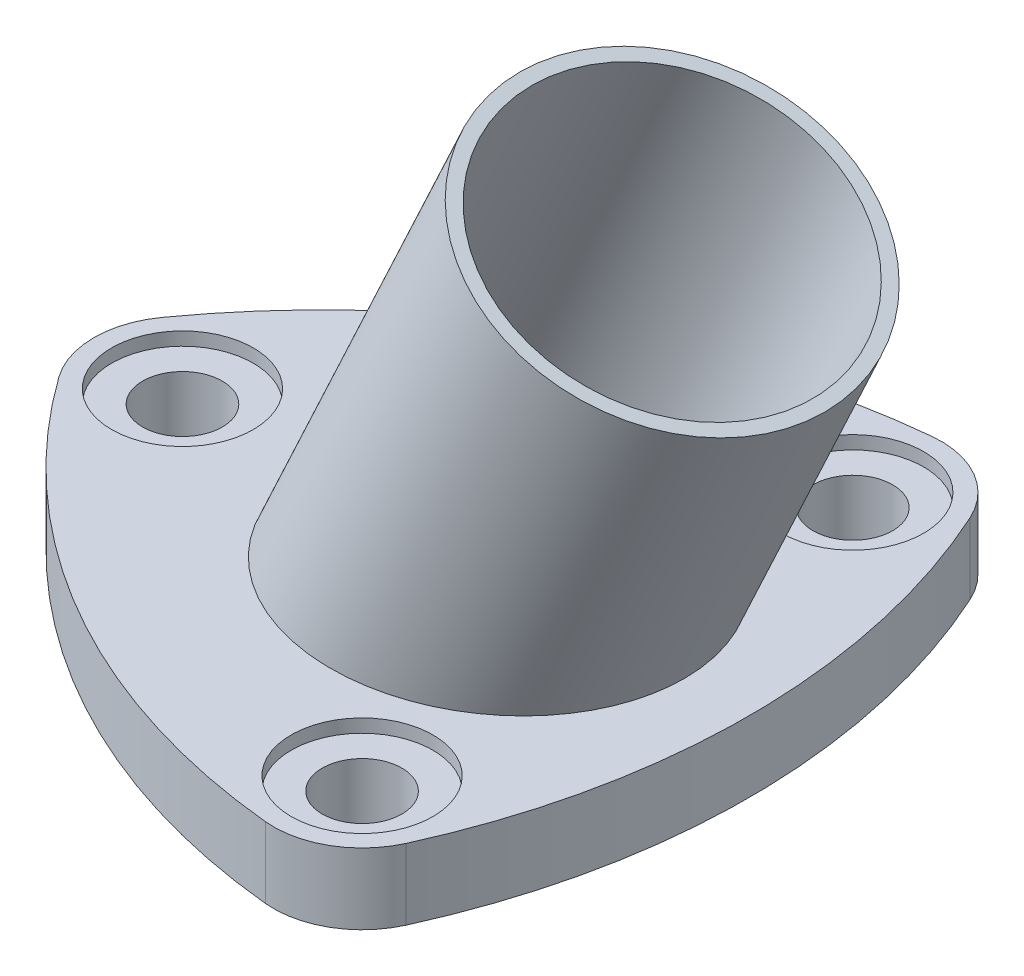
ISO-10303-21;
HEADER;
FILE_DESCRIPTION(('STEP AP214'),'2;1');
FILE_NAME('part.step','',(''),(''),'','','');
FILE_SCHEMA(('AUTOMOTIVE_DESIGN { 1 0 10303 214 1 1 1 1 }'));
ENDSEC;
DATA;
#1=APPLICATION_CONTEXT('core data for automotive mechanical design processes');
#2=APPLICATION_PROTOCOL_DEFINITION('international standard','automotive_design',2000,#1);
#3=PRODUCT_CONTEXT('',#1,'mechanical');
#4=PRODUCT('Part','Part','',(#3));
#5=PRODUCT_RELATED_PRODUCT_CATEGORY('part','',(#4));
#6=PRODUCT_DEFINITION_FORMATION('','',#4);
#7=PRODUCT_DEFINITION_CONTEXT('part definition',#1,'design');
#8=PRODUCT_DEFINITION('design','',#6,#7);
#9=PRODUCT_DEFINITION_SHAPE('','',#8);
#10=(LENGTH_UNIT() NAMED_UNIT(*) SI_UNIT(.MILLI.,.METRE.));
#11=(NAMED_UNIT(*) PLANE_ANGLE_UNIT() SI_UNIT($,.RADIAN.));
#12=(NAMED_UNIT(*) SI_UNIT($,.STERADIAN.) SOLID_ANGLE_UNIT());
#13=UNCERTAINTY_MEASURE_WITH_UNIT(LENGTH_MEASURE(1.E-05),#10,'distance_accuracy_value','');
#14=(GEOMETRIC_REPRESENTATION_CONTEXT(3) GLOBAL_UNCERTAINTY_ASSIGNED_CONTEXT((#13)) GLOBAL_UNIT_ASSIGNED_CONTEXT((#10,
#11,#12)) REPRESENTATION_CONTEXT('',''));
#15=CARTESIAN_POINT('',(0.,0.,0.));
#16=DIRECTION('',(0.,0.,1.));
#17=DIRECTION('',(1.,0.,0.));
#18=AXIS2_PLACEMENT_3D('',#15,#16,#17);
#19=CARTESIAN_POINT('',(-32.,8.,0.));
#20=DIRECTION('',(0.,-1.,0.));
#21=DIRECTION('',(0.,0.,-1.));
#22=AXIS2_PLACEMENT_3D('',#19,#20,#21);
#23=CYLINDRICAL_SURFACE('',#22,4.50000000000001);
#24=CARTESIAN_POINT('',(-32.,0.,0.));
#25=DIRECTION('',(0.,1.,0.));
#26=DIRECTION('',(0.,0.,1.));
#27=AXIS2_PLACEMENT_3D('',#24,#25,#26);
#28=CIRCLE('',#27,4.50000000000001);
#29=CARTESIAN_POINT('',(-32.,0.,4.50000000000001));
#30=VERTEX_POINT('',#29);
#31=EDGE_CURVE('E123',#30,#30,#28,.T.);
#32=ORIENTED_EDGE('',*,*,#31,.F.);
#33=EDGE_LOOP('',(#32));
#34=FACE_BOUND('',#33,.T.);
#35=CARTESIAN_POINT('',(-32.,6.5,0.));
#36=DIRECTION('',(0.,1.,0.));
#37=DIRECTION('',(0.,0.,1.));
#38=AXIS2_PLACEMENT_3D('',#35,#36,#37);
#39=CIRCLE('',#38,4.50000000000001);
#40=CARTESIAN_POINT('',(-32.,6.5,4.50000000000001));
#41=VERTEX_POINT('',#40);
#42=EDGE_CURVE('E144',#41,#41,#39,.T.);
#43=ORIENTED_EDGE('',*,*,#42,.T.);
#44=EDGE_LOOP('',(#43));
#45=FACE_BOUND('',#44,.T.);
#46=ADVANCED_FACE('F33',(#34,#45),#23,.F.);
#47=CARTESIAN_POINT('',(16.,8.,-27.712812921102));
#48=DIRECTION('',(0.,-1.,0.));
#49=DIRECTION('',(0.,0.,-1.));
#50=AXIS2_PLACEMENT_3D('',#47,#48,#49);
#51=CYLINDRICAL_SURFACE('',#50,4.50000000000004);
#52=CARTESIAN_POINT('',(16.,0.,-27.712812921102));
#53=DIRECTION('',(0.,1.,0.));
#54=DIRECTION('',(0.,0.,1.));
#55=AXIS2_PLACEMENT_3D('',#52,#53,#54);
#56=CIRCLE('',#55,4.50000000000004);
#57=CARTESIAN_POINT('',(16.,0.,-23.212812921102));
#58=VERTEX_POINT('',#57);
#59=EDGE_CURVE('E150',#58,#58,#56,.T.);
#60=ORIENTED_EDGE('',*,*,#59,.F.);
#61=EDGE_LOOP('',(#60));
#62=FACE_BOUND('',#61,.T.);
#63=CARTESIAN_POINT('',(16.,6.5,-27.712812921102));
#64=DIRECTION('',(0.,1.,0.));
#65=DIRECTION('',(0.,0.,1.));
#66=AXIS2_PLACEMENT_3D('',#63,#64,#65);
#67=CIRCLE('',#66,4.50000000000004);
#68=CARTESIAN_POINT('',(16.,6.5,-23.212812921102));
#69=VERTEX_POINT('',#68);
#70=EDGE_CURVE('E141',#69,#69,#67,.T.);
#71=ORIENTED_EDGE('',*,*,#70,.T.);
#72=EDGE_LOOP('',(#71));
#73=FACE_BOUND('',#72,.T.);
#74=ADVANCED_FACE('F188',(#62,#73),#51,.F.);
#75=CARTESIAN_POINT('',(16.,8.,27.712812921102));
#76=DIRECTION('',(0.,-1.,0.));
#77=DIRECTION('',(0.,0.,-1.));
#78=AXIS2_PLACEMENT_3D('',#75,#76,#77);
#79=CYLINDRICAL_SURFACE('',#78,4.5000000000001);
#80=CARTESIAN_POINT('',(16.,0.,27.712812921102));
#81=DIRECTION('',(0.,1.,0.));
#82=DIRECTION('',(0.,0.,1.));
#83=AXIS2_PLACEMENT_3D('',#80,#81,#82);
#84=CIRCLE('',#83,4.5000000000001);
#85=CARTESIAN_POINT('',(16.,0.,32.2128129211021));
#86=VERTEX_POINT('',#85);
#87=EDGE_CURVE('E146',#86,#86,#84,.T.);
#88=ORIENTED_EDGE('',*,*,#87,.F.);
#89=EDGE_LOOP('',(#88));
#90=FACE_BOUND('',#89,.T.);
#91=CARTESIAN_POINT('',(16.,6.5,27.712812921102));
#92=DIRECTION('',(0.,1.,0.));
#93=DIRECTION('',(0.,0.,1.));
#94=AXIS2_PLACEMENT_3D('',#91,#92,#93);
#95=CIRCLE('',#94,4.5000000000001);
#96=CARTESIAN_POINT('',(16.,6.5,32.2128129211021));
#97=VERTEX_POINT('',#96);
#98=EDGE_CURVE('E138',#97,#97,#95,.T.);
#99=ORIENTED_EDGE('',*,*,#98,.T.);
#100=EDGE_LOOP('',(#99));
#101=FACE_BOUND('',#100,.T.);
#102=ADVANCED_FACE('F194',(#90,#101),#79,.F.);
#103=CARTESIAN_POINT('',(19.25,8.,-5.62916512459887));
#104=DIRECTION('',(0.,1.,0.));
#105=DIRECTION('',(0.,0.,1.));
#106=AXIS2_PLACEMENT_3D('',#103,#104,#105);
#107=PLANE('',#106);
#108=CARTESIAN_POINT('',(3.73046126523997,8.,0.));
#109=DIRECTION('',(0.,1.,0.));
#110=DIRECTION('',(1.,0.,0.));
#111=AXIS2_PLACEMENT_3D('',#108,#109,#110);
#112=ELLIPSE('',#111,20.9641804602873,19.);
#113=CARTESIAN_POINT('',(24.6946417255273,8.,0.));
#114=VERTEX_POINT('',#113);
#115=EDGE_CURVE('E11',#114,#114,#112,.T.);
#116=ORIENTED_EDGE('',*,*,#115,.F.);
#117=EDGE_LOOP('',(#116));
#118=FACE_BOUND('',#117,.T.);
#119=CARTESIAN_POINT('',(-32.,8.,0.));
#120=DIRECTION('',(0.,1.,0.));
#121=DIRECTION('',(0.,0.,1.));
#122=AXIS2_PLACEMENT_3D('',#119,#120,#121);
#123=CIRCLE('',#122,8.);
#124=CARTESIAN_POINT('',(-32.,8.,8.));
#125=VERTEX_POINT('',#124);
#126=EDGE_CURVE('E221',#125,#125,#123,.T.);
#127=ORIENTED_EDGE('',*,*,#126,.F.);
#128=EDGE_LOOP('',(#127));
#129=FACE_BOUND('',#128,.T.);
#130=CARTESIAN_POINT('',(16.0000000000001,8.,-27.712812921102));
#131=DIRECTION('',(0.,1.,0.));
#132=DIRECTION('',(0.,0.,1.));
#133=AXIS2_PLACEMENT_3D('',#130,#131,#132);
#134=CIRCLE('',#133,8.00000000000001);
#135=CARTESIAN_POINT('',(16.0000000000001,8.,-19.712812921102));
#136=VERTEX_POINT('',#135);
#137=EDGE_CURVE('E227',#136,#136,#134,.T.);
#138=ORIENTED_EDGE('',*,*,#137,.F.);
#139=EDGE_LOOP('',(#138));
#140=FACE_BOUND('',#139,.T.);
#141=CARTESIAN_POINT('',(15.9999999999998,8.,27.7128129211022));
#142=DIRECTION('',(0.,1.,0.));
#143=DIRECTION('',(0.,0.,1.));
#144=AXIS2_PLACEMENT_3D('',#141,#142,#143);
#145=CIRCLE('',#144,8.);
#146=CARTESIAN_POINT('',(15.9999999999998,8.,35.7128129211022));
#147=VERTEX_POINT('',#146);
#148=EDGE_CURVE('E157',#147,#147,#145,.T.);
#149=ORIENTED_EDGE('',*,*,#148,.F.);
#150=EDGE_LOOP('',(#149));
#151=FACE_BOUND('',#150,.T.);
#152=CARTESIAN_POINT('',(22.5,8.,-38.9711431702998));
#153=DIRECTION('',(0.,1.,0.));
#154=DIRECTION('',(0.,0.,1.));
#155=AXIS2_PLACEMENT_3D('',#152,#153,#154);
#156=CIRCLE('',#155,77.);
#157=CARTESIAN_POINT('',(-40.1343283582089,8.,5.81658853288056));
#158=VERTEX_POINT('',#157);
#159=CARTESIAN_POINT('',(15.0298507462687,8.,37.6656421884754));
#160=VERTEX_POINT('',#159);
#161=EDGE_CURVE('E130',#158,#160,#156,.T.);
#162=ORIENTED_EDGE('',*,*,#161,.T.);
#163=CARTESIAN_POINT('',(16.,8.,27.712812921102));
#164=DIRECTION('',(0.,1.,0.));
#165=DIRECTION('',(0.,0.,1.));
#166=AXIS2_PLACEMENT_3D('',#163,#164,#165);
#167=CIRCLE('',#166,10.);
#168=CARTESIAN_POINT('',(25.1044776119403,8.,31.8490536555949));
#169=VERTEX_POINT('',#168);
#170=EDGE_CURVE('E88',#160,#169,#167,.T.);
#171=ORIENTED_EDGE('',*,*,#170,.T.);
#172=CARTESIAN_POINT('',(-45.,8.,0.));
#173=DIRECTION('',(0.,1.,0.));
#174=DIRECTION('',(0.,0.,-1.));
#175=AXIS2_PLACEMENT_3D('',#172,#173,#174);
#176=CIRCLE('',#175,77.);
#177=CARTESIAN_POINT('',(25.1044776119403,8.,-31.8490536555949));
#178=VERTEX_POINT('',#177);
#179=EDGE_CURVE('E101',#169,#178,#176,.T.);
#180=ORIENTED_EDGE('',*,*,#179,.T.);
#181=CARTESIAN_POINT('',(16.,8.,-27.712812921102));
#182=DIRECTION('',(0.,1.,0.));
#183=DIRECTION('',(0.,0.,-1.));
#184=AXIS2_PLACEMENT_3D('',#181,#182,#183);
#185=CIRCLE('',#184,9.99999999999999);
#186=CARTESIAN_POINT('',(15.0298507462686,8.,-37.6656421884754));
#187=VERTEX_POINT('',#186);
#188=EDGE_CURVE('E95',#178,#187,#185,.T.);
#189=ORIENTED_EDGE('',*,*,#188,.T.);
#190=CARTESIAN_POINT('',(22.5000000000001,8.,38.9711431702998));
#191=DIRECTION('',(0.,1.,0.));
#192=DIRECTION('',(0.,0.,-1.));
#193=AXIS2_PLACEMENT_3D('',#190,#191,#192);
#194=CIRCLE('',#193,77.0000000000001);
#195=CARTESIAN_POINT('',(-40.1343283582089,8.,-5.81658853288055));
#196=VERTEX_POINT('',#195);
#197=EDGE_CURVE('E99',#187,#196,#194,.T.);
#198=ORIENTED_EDGE('',*,*,#197,.T.);
#199=CARTESIAN_POINT('',(-32.,8.,0.));
#200=DIRECTION('',(0.,1.,0.));
#201=DIRECTION('',(0.,0.,-1.));
#202=AXIS2_PLACEMENT_3D('',#199,#200,#201);
#203=CIRCLE('',#202,9.99999999999998);
#204=EDGE_CURVE('E50',#196,#158,#203,.T.);
#205=ORIENTED_EDGE('',*,*,#204,.T.);
#206=EDGE_LOOP('',(#162,#171,#180,#189,#198,#205));
#207=FACE_BOUND('',#206,.T.);
#208=ADVANCED_FACE('F97',(#118,#129,#140,#151,#207),#107,.T.);
#209=CARTESIAN_POINT('',(19.25,0.,-5.62916512459887));
#210=DIRECTION('',(0.,1.,0.));
#211=DIRECTION('',(0.,0.,1.));
#212=AXIS2_PLACEMENT_3D('',#209,#210,#211);
#213=PLANE('',#212);
#214=CARTESIAN_POINT('',(0.,0.,0.));
#215=DIRECTION('',(0.,1.,0.));
#216=DIRECTION('',(1.,0.,0.));
#217=AXIS2_PLACEMENT_3D('',#214,#215,#216);
#218=ELLIPSE('',#217,19.3091135818436,17.5);
#219=CARTESIAN_POINT('',(19.3091135818436,0.,0.));
#220=VERTEX_POINT('',#219);
#221=EDGE_CURVE('E209',#220,#220,#218,.T.);
#222=ORIENTED_EDGE('',*,*,#221,.T.);
#223=EDGE_LOOP('',(#222));
#224=FACE_BOUND('',#223,.T.);
#225=CARTESIAN_POINT('',(22.5,0.,-38.9711431702998));
#226=DIRECTION('',(0.,1.,0.));
#227=DIRECTION('',(0.,0.,1.));
#228=AXIS2_PLACEMENT_3D('',#225,#226,#227);
#229=CIRCLE('',#228,77.);
#230=CARTESIAN_POINT('',(-40.1343283582089,0.,5.81658853288056));
#231=VERTEX_POINT('',#230);
#232=CARTESIAN_POINT('',(15.0298507462687,0.,37.6656421884754));
#233=VERTEX_POINT('',#232);
#234=EDGE_CURVE('E119',#231,#233,#229,.T.);
#235=ORIENTED_EDGE('',*,*,#234,.F.);
#236=CARTESIAN_POINT('',(-32.,0.,0.));
#237=DIRECTION('',(0.,1.,0.));
#238=DIRECTION('',(0.,0.,-1.));
#239=AXIS2_PLACEMENT_3D('',#236,#237,#238);
#240=CIRCLE('',#239,9.99999999999998);
#241=CARTESIAN_POINT('',(-40.1343283582089,0.,-5.81658853288055));
#242=VERTEX_POINT('',#241);
#243=EDGE_CURVE('E79',#242,#231,#240,.T.);
#244=ORIENTED_EDGE('',*,*,#243,.F.);
#245=CARTESIAN_POINT('',(22.5000000000001,0.,38.9711431702998));
#246=DIRECTION('',(0.,1.,0.));
#247=DIRECTION('',(0.,0.,-1.));
#248=AXIS2_PLACEMENT_3D('',#245,#246,#247);
#249=CIRCLE('',#248,77.0000000000001);
#250=CARTESIAN_POINT('',(15.0298507462686,0.,-37.6656421884754));
#251=VERTEX_POINT('',#250);
#252=EDGE_CURVE('E73',#251,#242,#249,.T.);
#253=ORIENTED_EDGE('',*,*,#252,.F.);
#254=CARTESIAN_POINT('',(16.,0.,-27.712812921102));
#255=DIRECTION('',(0.,1.,0.));
#256=DIRECTION('',(0.,0.,-1.));
#257=AXIS2_PLACEMENT_3D('',#254,#255,#256);
#258=CIRCLE('',#257,9.99999999999999);
#259=CARTESIAN_POINT('',(25.1044776119403,0.,-31.8490536555949));
#260=VERTEX_POINT('',#259);
#261=EDGE_CURVE('E109',#260,#251,#258,.T.);
#262=ORIENTED_EDGE('',*,*,#261,.F.);
#263=CARTESIAN_POINT('',(-45.,0.,0.));
#264=DIRECTION('',(0.,1.,0.));
#265=DIRECTION('',(0.,0.,-1.));
#266=AXIS2_PLACEMENT_3D('',#263,#264,#265);
#267=CIRCLE('',#266,77.);
#268=CARTESIAN_POINT('',(25.1044776119403,0.,31.8490536555949));
#269=VERTEX_POINT('',#268);
#270=EDGE_CURVE('E125',#269,#260,#267,.T.);
#271=ORIENTED_EDGE('',*,*,#270,.F.);
#272=CARTESIAN_POINT('',(16.,0.,27.712812921102));
#273=DIRECTION('',(0.,1.,0.));
#274=DIRECTION('',(0.,0.,1.));
#275=AXIS2_PLACEMENT_3D('',#272,#273,#274);
#276=CIRCLE('',#275,10.);
#277=EDGE_CURVE('E122',#233,#269,#276,.T.);
#278=ORIENTED_EDGE('',*,*,#277,.F.);
#279=EDGE_LOOP('',(#235,#244,#253,#262,#271,#278));
#280=FACE_BOUND('',#279,.T.);
#281=ORIENTED_EDGE('',*,*,#31,.T.);
#282=EDGE_LOOP('',(#281));
#283=FACE_BOUND('',#282,.T.);
#284=ORIENTED_EDGE('',*,*,#59,.T.);
#285=EDGE_LOOP('',(#284));
#286=FACE_BOUND('',#285,.T.);
#287=ORIENTED_EDGE('',*,*,#87,.T.);
#288=EDGE_LOOP('',(#287));
#289=FACE_BOUND('',#288,.T.);
#290=ADVANCED_FACE('F171',(#224,#280,#283,#286,#289),#213,.F.);
#291=CARTESIAN_POINT('',(22.5,8.,-38.9711431702998));
#292=DIRECTION('',(0.,-1.,0.));
#293=DIRECTION('',(0.,0.,-1.));
#294=AXIS2_PLACEMENT_3D('',#291,#292,#293);
#295=CYLINDRICAL_SURFACE('',#294,77.);
#296=ORIENTED_EDGE('',*,*,#234,.T.);
#297=DIRECTION('',(0.,-1.,0.));
#298=VECTOR('',#297,1.);
#299=CARTESIAN_POINT('',(15.0298507462687,8.,37.6656421884754));
#300=LINE('',#299,#298);
#301=EDGE_CURVE('E42',#160,#233,#300,.T.);
#302=ORIENTED_EDGE('',*,*,#301,.F.);
#303=ORIENTED_EDGE('',*,*,#161,.F.);
#304=DIRECTION('',(0.,-1.,0.));
#305=VECTOR('',#304,1.);
#306=CARTESIAN_POINT('',(-40.1343283582089,8.,5.81658853288056));
#307=LINE('',#306,#305);
#308=EDGE_CURVE('E115',#158,#231,#307,.T.);
#309=ORIENTED_EDGE('',*,*,#308,.T.);
#310=EDGE_LOOP('',(#296,#302,#303,#309));
#311=FACE_BOUND('',#310,.T.);
#312=ADVANCED_FACE('F35',(#311),#295,.T.);
#313=CARTESIAN_POINT('',(16.,8.,27.712812921102));
#314=DIRECTION('',(0.,-1.,0.));
#315=DIRECTION('',(0.,0.,-1.));
#316=AXIS2_PLACEMENT_3D('',#313,#314,#315);
#317=CYLINDRICAL_SURFACE('',#316,10.);
#318=ORIENTED_EDGE('',*,*,#277,.T.);
#319=DIRECTION('',(0.,-1.,0.));
#320=VECTOR('',#319,1.);
#321=CARTESIAN_POINT('',(25.1044776119403,8.,31.8490536555949));
#322=LINE('',#321,#320);
#323=EDGE_CURVE('E134',#169,#269,#322,.T.);
#324=ORIENTED_EDGE('',*,*,#323,.F.);
#325=ORIENTED_EDGE('',*,*,#170,.F.);
#326=ORIENTED_EDGE('',*,*,#301,.T.);
#327=EDGE_LOOP('',(#318,#324,#325,#326));
#328=FACE_BOUND('',#327,.T.);
#329=ADVANCED_FACE('F165',(#328),#317,.T.);
#330=CARTESIAN_POINT('',(-45.,8.,0.));
#331=DIRECTION('',(0.,-1.,0.));
#332=DIRECTION('',(0.,0.,-1.));
#333=AXIS2_PLACEMENT_3D('',#330,#331,#332);
#334=CYLINDRICAL_SURFACE('',#333,77.);
#335=ORIENTED_EDGE('',*,*,#270,.T.);
#336=DIRECTION('',(0.,-1.,0.));
#337=VECTOR('',#336,1.);
#338=CARTESIAN_POINT('',(25.1044776119403,8.,-31.8490536555949));
#339=LINE('',#338,#337);
#340=EDGE_CURVE('E110',#178,#260,#339,.T.);
#341=ORIENTED_EDGE('',*,*,#340,.F.);
#342=ORIENTED_EDGE('',*,*,#179,.F.);
#343=ORIENTED_EDGE('',*,*,#323,.T.);
#344=EDGE_LOOP('',(#335,#341,#342,#343));
#345=FACE_BOUND('',#344,.T.);
#346=ADVANCED_FACE('F168',(#345),#334,.T.);
#347=CARTESIAN_POINT('',(16.,8.,-27.712812921102));
#348=DIRECTION('',(0.,-1.,0.));
#349=DIRECTION('',(0.,0.,-1.));
#350=AXIS2_PLACEMENT_3D('',#347,#348,#349);
#351=CYLINDRICAL_SURFACE('',#350,9.99999999999999);
#352=ORIENTED_EDGE('',*,*,#261,.T.);
#353=DIRECTION('',(0.,-1.,0.));
#354=VECTOR('',#353,1.);
#355=CARTESIAN_POINT('',(15.0298507462686,8.,-37.6656421884754));
#356=LINE('',#355,#354);
#357=EDGE_CURVE('E106',#187,#251,#356,.T.);
#358=ORIENTED_EDGE('',*,*,#357,.F.);
#359=ORIENTED_EDGE('',*,*,#188,.F.);
#360=ORIENTED_EDGE('',*,*,#340,.T.);
#361=EDGE_LOOP('',(#352,#358,#359,#360));
#362=FACE_BOUND('',#361,.T.);
#363=ADVANCED_FACE('F107',(#362),#351,.T.);
#364=CARTESIAN_POINT('',(22.5000000000001,8.,38.9711431702998));
#365=DIRECTION('',(0.,-1.,0.));
#366=DIRECTION('',(0.,0.,-1.));
#367=AXIS2_PLACEMENT_3D('',#364,#365,#366);
#368=CYLINDRICAL_SURFACE('',#367,77.0000000000001);
#369=ORIENTED_EDGE('',*,*,#252,.T.);
#370=DIRECTION('',(0.,-1.,0.));
#371=VECTOR('',#370,1.);
#372=CARTESIAN_POINT('',(-40.1343283582089,8.,-5.81658853288055));
#373=LINE('',#372,#371);
#374=EDGE_CURVE('E111',#196,#242,#373,.T.);
#375=ORIENTED_EDGE('',*,*,#374,.F.);
#376=ORIENTED_EDGE('',*,*,#197,.F.);
#377=ORIENTED_EDGE('',*,*,#357,.T.);
#378=EDGE_LOOP('',(#369,#375,#376,#377));
#379=FACE_BOUND('',#378,.T.);
#380=ADVANCED_FACE('F113',(#379),#368,.T.);
#381=CARTESIAN_POINT('',(-32.,8.,0.));
#382=DIRECTION('',(0.,-1.,0.));
#383=DIRECTION('',(0.,0.,-1.));
#384=AXIS2_PLACEMENT_3D('',#381,#382,#383);
#385=CYLINDRICAL_SURFACE('',#384,9.99999999999998);
#386=ORIENTED_EDGE('',*,*,#243,.T.);
#387=ORIENTED_EDGE('',*,*,#308,.F.);
#388=ORIENTED_EDGE('',*,*,#204,.F.);
#389=ORIENTED_EDGE('',*,*,#374,.T.);
#390=EDGE_LOOP('',(#386,#387,#388,#389));
#391=FACE_BOUND('',#390,.T.);
#392=ADVANCED_FACE('F174',(#391),#385,.T.);
#393=CARTESIAN_POINT('',(15.9999999999998,6.5,27.7128129211022));
#394=DIRECTION('',(0.,1.,0.));
#395=DIRECTION('',(0.,0.,1.));
#396=AXIS2_PLACEMENT_3D('',#393,#394,#395);
#397=CYLINDRICAL_SURFACE('',#396,8.);
#398=CARTESIAN_POINT('',(15.9999999999998,6.5,27.7128129211022));
#399=DIRECTION('',(0.,1.,0.));
#400=DIRECTION('',(0.,0.,1.));
#401=AXIS2_PLACEMENT_3D('',#398,#399,#400);
#402=CIRCLE('',#401,8.);
#403=CARTESIAN_POINT('',(15.9999999999998,6.5,35.7128129211022));
#404=VERTEX_POINT('',#403);
#405=EDGE_CURVE('E229',#404,#404,#402,.T.);
#406=ORIENTED_EDGE('',*,*,#405,.F.);
#407=EDGE_LOOP('',(#406));
#408=FACE_BOUND('',#407,.T.);
#409=ORIENTED_EDGE('',*,*,#148,.T.);
#410=EDGE_LOOP('',(#409));
#411=FACE_BOUND('',#410,.T.);
#412=ADVANCED_FACE('F176',(#408,#411),#397,.F.);
#413=CARTESIAN_POINT('',(15.9999999999998,6.5,27.7128129211022));
#414=DIRECTION('',(0.,1.,0.));
#415=DIRECTION('',(0.,0.,1.));
#416=AXIS2_PLACEMENT_3D('',#413,#414,#415);
#417=PLANE('',#416);
#418=ORIENTED_EDGE('',*,*,#98,.F.);
#419=EDGE_LOOP('',(#418));
#420=FACE_BOUND('',#419,.T.);
#421=ORIENTED_EDGE('',*,*,#405,.T.);
#422=EDGE_LOOP('',(#421));
#423=FACE_BOUND('',#422,.T.);
#424=ADVANCED_FACE('F182',(#420,#423),#417,.T.);
#425=CARTESIAN_POINT('',(16.0000000000001,6.5,-27.712812921102));
#426=DIRECTION('',(0.,1.,0.));
#427=DIRECTION('',(0.,0.,1.));
#428=AXIS2_PLACEMENT_3D('',#425,#426,#427);
#429=CYLINDRICAL_SURFACE('',#428,8.00000000000001);
#430=CARTESIAN_POINT('',(16.0000000000001,6.5,-27.712812921102));
#431=DIRECTION('',(0.,1.,0.));
#432=DIRECTION('',(0.,0.,1.));
#433=AXIS2_PLACEMENT_3D('',#430,#431,#432);
#434=CIRCLE('',#433,8.00000000000001);
#435=CARTESIAN_POINT('',(16.0000000000001,6.5,-19.712812921102));
#436=VERTEX_POINT('',#435);
#437=EDGE_CURVE('E224',#436,#436,#434,.T.);
#438=ORIENTED_EDGE('',*,*,#437,.F.);
#439=EDGE_LOOP('',(#438));
#440=FACE_BOUND('',#439,.T.);
#441=ORIENTED_EDGE('',*,*,#137,.T.);
#442=EDGE_LOOP('',(#441));
#443=FACE_BOUND('',#442,.T.);
#444=ADVANCED_FACE('F238',(#440,#443),#429,.F.);
#445=CARTESIAN_POINT('',(16.0000000000001,6.5,-27.712812921102));
#446=DIRECTION('',(0.,1.,0.));
#447=DIRECTION('',(0.,0.,1.));
#448=AXIS2_PLACEMENT_3D('',#445,#446,#447);
#449=PLANE('',#448);
#450=ORIENTED_EDGE('',*,*,#70,.F.);
#451=EDGE_LOOP('',(#450));
#452=FACE_BOUND('',#451,.T.);
#453=ORIENTED_EDGE('',*,*,#437,.T.);
#454=EDGE_LOOP('',(#453));
#455=FACE_BOUND('',#454,.T.);
#456=ADVANCED_FACE('F244',(#452,#455),#449,.T.);
#457=CARTESIAN_POINT('',(-32.,6.5,0.));
#458=DIRECTION('',(0.,1.,0.));
#459=DIRECTION('',(0.,0.,1.));
#460=AXIS2_PLACEMENT_3D('',#457,#458,#459);
#461=CYLINDRICAL_SURFACE('',#460,8.);
#462=CARTESIAN_POINT('',(-32.,6.5,0.));
#463=DIRECTION('',(0.,1.,0.));
#464=DIRECTION('',(0.,0.,1.));
#465=AXIS2_PLACEMENT_3D('',#462,#463,#464);
#466=CIRCLE('',#465,8.);
#467=CARTESIAN_POINT('',(-32.,6.5,8.));
#468=VERTEX_POINT('',#467);
#469=EDGE_CURVE('E142',#468,#468,#466,.T.);
#470=ORIENTED_EDGE('',*,*,#469,.F.);
#471=EDGE_LOOP('',(#470));
#472=FACE_BOUND('',#471,.T.);
#473=ORIENTED_EDGE('',*,*,#126,.T.);
#474=EDGE_LOOP('',(#473));
#475=FACE_BOUND('',#474,.T.);
#476=ADVANCED_FACE('F308',(#472,#475),#461,.F.);
#477=CARTESIAN_POINT('',(-32.,6.5,0.));
#478=DIRECTION('',(0.,1.,0.));
#479=DIRECTION('',(0.,0.,1.));
#480=AXIS2_PLACEMENT_3D('',#477,#478,#479);
#481=PLANE('',#480);
#482=ORIENTED_EDGE('',*,*,#42,.F.);
#483=EDGE_LOOP('',(#482));
#484=FACE_BOUND('',#483,.T.);
#485=ORIENTED_EDGE('',*,*,#469,.T.);
#486=EDGE_LOOP('',(#485));
#487=FACE_BOUND('',#486,.T.);
#488=ADVANCED_FACE('F268',(#484,#487),#481,.T.);
#489=CARTESIAN_POINT('',(-20.155029480128,-43.2226002032088,0.));
#490=DIRECTION('',(0.422618261740697,0.906307787036651,0.));
#491=DIRECTION('',(-0.906307787036651,0.422618261740697,0.));
#492=AXIS2_PLACEMENT_3D('',#489,#490,#491);
#493=CYLINDRICAL_SURFACE('',#492,19.);
#494=ORIENTED_EDGE('',*,*,#115,.T.);
#495=EDGE_LOOP('',(#494));
#496=FACE_BOUND('',#495,.T.);
#497=CARTESIAN_POINT('',(23.3153829077498,50.,0.));
#498=DIRECTION('',(0.422618261740697,0.906307787036651,0.));
#499=DIRECTION('',(-0.906307787036651,0.422618261740697,0.));
#500=AXIS2_PLACEMENT_3D('',#497,#498,#499);
#501=CIRCLE('',#500,19.);
#502=CARTESIAN_POINT('',(6.09553495405342,58.0297469730733,0.));
#503=VERTEX_POINT('',#502);
#504=EDGE_CURVE('E211',#503,#503,#501,.T.);
#505=ORIENTED_EDGE('',*,*,#504,.F.);
#506=EDGE_LOOP('',(#505));
#507=FACE_BOUND('',#506,.T.);
#508=ADVANCED_FACE('F273',(#496,#507),#493,.T.);
#509=CARTESIAN_POINT('',(23.3153829077498,50.,0.));
#510=DIRECTION('',(0.422618261740697,0.906307787036651,0.));
#511=DIRECTION('',(-0.906307787036651,0.422618261740697,0.));
#512=AXIS2_PLACEMENT_3D('',#509,#510,#511);
#513=PLANE('',#512);
#514=CARTESIAN_POINT('',(23.3153829077498,50.,0.));
#515=DIRECTION('',(0.422618261740697,0.906307787036651,0.));
#516=DIRECTION('',(-0.906307787036651,0.422618261740697,0.));
#517=AXIS2_PLACEMENT_3D('',#514,#515,#516);
#518=CIRCLE('',#517,17.5);
#519=CARTESIAN_POINT('',(7.4549966346084,57.3958195804622,0.));
#520=VERTEX_POINT('',#519);
#521=EDGE_CURVE('E212',#520,#520,#518,.T.);
#522=ORIENTED_EDGE('',*,*,#521,.F.);
#523=EDGE_LOOP('',(#522));
#524=FACE_BOUND('',#523,.T.);
#525=ORIENTED_EDGE('',*,*,#504,.T.);
#526=EDGE_LOOP('',(#525));
#527=FACE_BOUND('',#526,.T.);
#528=ADVANCED_FACE('F277',(#524,#527),#513,.T.);
#529=CARTESIAN_POINT('',(-7.50146019658261,-16.0869333054985,0.));
#530=DIRECTION('',(0.422618261740697,0.906307787036651,0.));
#531=DIRECTION('',(-0.906307787036651,0.422618261740697,0.));
#532=AXIS2_PLACEMENT_3D('',#529,#530,#531);
#533=CYLINDRICAL_SURFACE('',#532,17.5);
#534=ORIENTED_EDGE('',*,*,#521,.T.);
#535=EDGE_LOOP('',(#534));
#536=FACE_BOUND('',#535,.T.);
#537=ORIENTED_EDGE('',*,*,#221,.F.);
#538=EDGE_LOOP('',(#537));
#539=FACE_BOUND('',#538,.T.);
#540=ADVANCED_FACE('F292',(#536,#539),#533,.F.);
#541=CLOSED_SHELL('',(#46,#74,#102,#208,#290,#312,#329,#346,#363,#380,#392,#412,#424,#444,#456,
#476,#488,#508,#528,#540));
#542=MANIFOLD_SOLID_BREP('B2',#541);
#543=ADVANCED_BREP_SHAPE_REPRESENTATION('',(#18,#542),#14);
#544=SHAPE_DEFINITION_REPRESENTATION(#9,#543);
ENDSEC;
END-ISO-10303-21;
